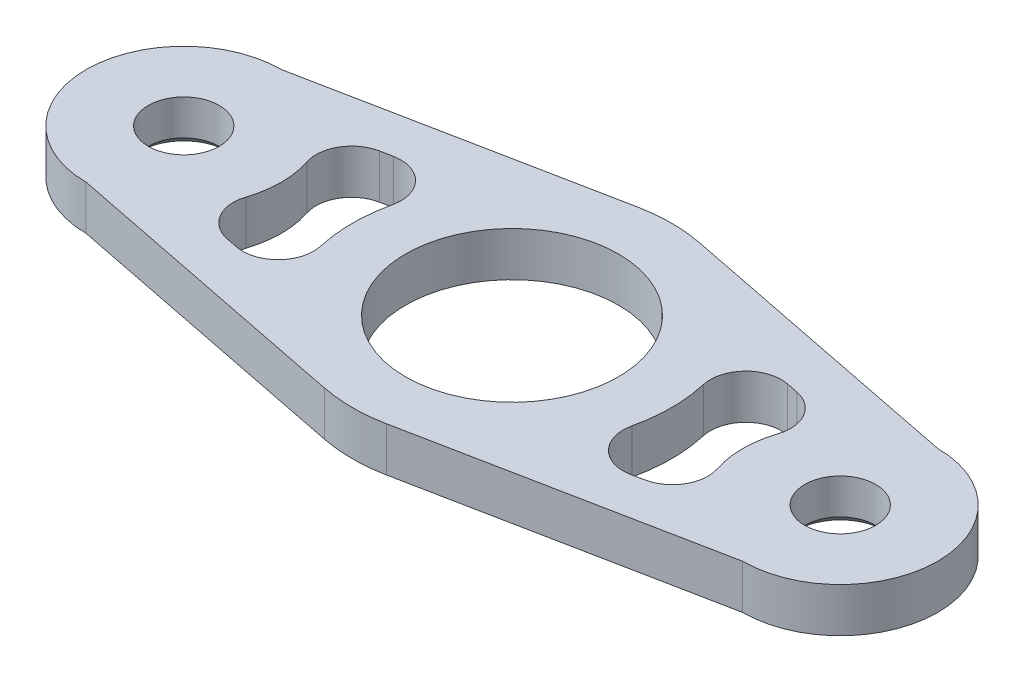
ISO-10303-21;
HEADER;
FILE_DESCRIPTION(('STEP AP214'),'2;1');
FILE_NAME('part.step','',(''),(''),'','','');
FILE_SCHEMA(('AUTOMOTIVE_DESIGN { 1 0 10303 214 1 1 1 1 }'));
ENDSEC;
DATA;
#1=APPLICATION_CONTEXT('core data for automotive mechanical design processes');
#2=APPLICATION_PROTOCOL_DEFINITION('international standard','automotive_design',2000,#1);
#3=PRODUCT_CONTEXT('',#1,'mechanical');
#4=PRODUCT('Part','Part','',(#3));
#5=PRODUCT_RELATED_PRODUCT_CATEGORY('part','',(#4));
#6=PRODUCT_DEFINITION_FORMATION('','',#4);
#7=PRODUCT_DEFINITION_CONTEXT('part definition',#1,'design');
#8=PRODUCT_DEFINITION('design','',#6,#7);
#9=PRODUCT_DEFINITION_SHAPE('','',#8);
#10=(LENGTH_UNIT() NAMED_UNIT(*) SI_UNIT(.MILLI.,.METRE.));
#11=(NAMED_UNIT(*) PLANE_ANGLE_UNIT() SI_UNIT($,.RADIAN.));
#12=(NAMED_UNIT(*) SI_UNIT($,.STERADIAN.) SOLID_ANGLE_UNIT());
#13=UNCERTAINTY_MEASURE_WITH_UNIT(LENGTH_MEASURE(1.E-05),#10,'distance_accuracy_value','');
#14=(GEOMETRIC_REPRESENTATION_CONTEXT(3) GLOBAL_UNCERTAINTY_ASSIGNED_CONTEXT((#13)) GLOBAL_UNIT_ASSIGNED_CONTEXT((#10,
#11,#12)) REPRESENTATION_CONTEXT('',''));
#15=CARTESIAN_POINT('',(0.,0.,0.));
#16=DIRECTION('',(0.,0.,1.));
#17=DIRECTION('',(1.,0.,0.));
#18=AXIS2_PLACEMENT_3D('',#15,#16,#17);
#19=CARTESIAN_POINT('',(3.50801681391295,2.5,-17.65485253502));
#20=DIRECTION('',(-0.194889822995164,0.,0.980825140834447));
#21=DIRECTION('',(0.980825140834447,0.,0.194889822995164));
#22=AXIS2_PLACEMENT_3D('',#19,#20,#21);
#23=PLANE('',#22);
#24=DIRECTION('',(-0.980825140834447,0.,-0.194889822995164));
#25=VECTOR('',#24,1.);
#26=CARTESIAN_POINT('',(3.50801681391295,-2.5,-17.65485253502));
#27=LINE('',#26,#25);
#28=CARTESIAN_POINT('',(37.,-2.5,-11.));
#29=VERTEX_POINT('',#28);
#30=CARTESIAN_POINT('',(3.50801681391295,-2.5,-17.65485253502));
#31=VERTEX_POINT('',#30);
#32=EDGE_CURVE('E232',#29,#31,#27,.T.);
#33=ORIENTED_EDGE('',*,*,#32,.T.);
#34=DIRECTION('',(0.,-1.,0.));
#35=VECTOR('',#34,1.);
#36=CARTESIAN_POINT('',(3.50801681391295,2.5,-17.65485253502));
#37=LINE('',#36,#35);
#38=CARTESIAN_POINT('',(3.50801681391295,2.5,-17.65485253502));
#39=VERTEX_POINT('',#38);
#40=EDGE_CURVE('E211',#39,#31,#37,.T.);
#41=ORIENTED_EDGE('',*,*,#40,.F.);
#42=DIRECTION('',(-0.980825140834447,0.,-0.194889822995164));
#43=VECTOR('',#42,1.);
#44=CARTESIAN_POINT('',(3.50801681391295,2.5,-17.65485253502));
#45=LINE('',#44,#43);
#46=CARTESIAN_POINT('',(37.,2.5,-11.));
#47=VERTEX_POINT('',#46);
#48=EDGE_CURVE('E219',#47,#39,#45,.T.);
#49=ORIENTED_EDGE('',*,*,#48,.F.);
#50=DIRECTION('',(0.,-1.,0.));
#51=VECTOR('',#50,1.);
#52=CARTESIAN_POINT('',(37.,2.5,-11.));
#53=LINE('',#52,#51);
#54=EDGE_CURVE('E435',#47,#29,#53,.T.);
#55=ORIENTED_EDGE('',*,*,#54,.T.);
#56=EDGE_LOOP('',(#33,#41,#49,#55));
#57=FACE_BOUND('',#56,.T.);
#58=ADVANCED_FACE('F41',(#57),#23,.F.);
#59=CARTESIAN_POINT('',(0.,2.5,0.));
#60=DIRECTION('',(0.,-1.,0.));
#61=DIRECTION('',(0.,0.,-1.));
#62=AXIS2_PLACEMENT_3D('',#59,#60,#61);
#63=CYLINDRICAL_SURFACE('',#62,18.);
#64=CARTESIAN_POINT('',(0.,-2.5,0.));
#65=DIRECTION('',(0.,1.,0.));
#66=DIRECTION('',(0.,0.,1.));
#67=AXIS2_PLACEMENT_3D('',#64,#65,#66);
#68=CIRCLE('',#67,18.);
#69=CARTESIAN_POINT('',(-3.50801681391295,-2.5,-17.65485253502));
#70=VERTEX_POINT('',#69);
#71=EDGE_CURVE('E473',#31,#70,#68,.T.);
#72=ORIENTED_EDGE('',*,*,#71,.T.);
#73=DIRECTION('',(0.,-1.,0.));
#74=VECTOR('',#73,1.);
#75=CARTESIAN_POINT('',(-3.50801681391295,2.5,-17.65485253502));
#76=LINE('',#75,#74);
#77=CARTESIAN_POINT('',(-3.50801681391295,2.5,-17.65485253502));
#78=VERTEX_POINT('',#77);
#79=EDGE_CURVE('E213',#78,#70,#76,.T.);
#80=ORIENTED_EDGE('',*,*,#79,.F.);
#81=CARTESIAN_POINT('',(0.,2.5,0.));
#82=DIRECTION('',(0.,1.,0.));
#83=DIRECTION('',(0.,0.,1.));
#84=AXIS2_PLACEMENT_3D('',#81,#82,#83);
#85=CIRCLE('',#84,18.);
#86=EDGE_CURVE('E206',#39,#78,#85,.T.);
#87=ORIENTED_EDGE('',*,*,#86,.F.);
#88=ORIENTED_EDGE('',*,*,#40,.T.);
#89=EDGE_LOOP('',(#72,#80,#87,#88));
#90=FACE_BOUND('',#89,.T.);
#91=ADVANCED_FACE('F209',(#90),#63,.T.);
#92=CARTESIAN_POINT('',(-3.50801681391296,2.5,-17.65485253502));
#93=DIRECTION('',(-0.194889822995164,0.,-0.980825140834447));
#94=DIRECTION('',(-0.980825140834447,0.,0.194889822995164));
#95=AXIS2_PLACEMENT_3D('',#92,#93,#94);
#96=PLANE('',#95);
#97=DIRECTION('',(0.980825140834447,0.,-0.194889822995164));
#98=VECTOR('',#97,1.);
#99=CARTESIAN_POINT('',(-3.50801681391296,-2.5,-17.65485253502));
#100=LINE('',#99,#98);
#101=CARTESIAN_POINT('',(-37.,-2.5,-11.));
#102=VERTEX_POINT('',#101);
#103=EDGE_CURVE('E476',#102,#70,#100,.T.);
#104=ORIENTED_EDGE('',*,*,#103,.F.);
#105=DIRECTION('',(0.,-1.,0.));
#106=VECTOR('',#105,1.);
#107=CARTESIAN_POINT('',(-37.,2.5,-11.));
#108=LINE('',#107,#106);
#109=CARTESIAN_POINT('',(-37.,2.5,-11.));
#110=VERTEX_POINT('',#109);
#111=EDGE_CURVE('E240',#110,#102,#108,.T.);
#112=ORIENTED_EDGE('',*,*,#111,.F.);
#113=DIRECTION('',(0.980825140834447,0.,-0.194889822995164));
#114=VECTOR('',#113,1.);
#115=CARTESIAN_POINT('',(-3.50801681391296,2.5,-17.65485253502));
#116=LINE('',#115,#114);
#117=EDGE_CURVE('E218',#110,#78,#116,.T.);
#118=ORIENTED_EDGE('',*,*,#117,.T.);
#119=ORIENTED_EDGE('',*,*,#79,.T.);
#120=EDGE_LOOP('',(#104,#112,#118,#119));
#121=FACE_BOUND('',#120,.T.);
#122=ADVANCED_FACE('F519',(#121),#96,.T.);
#123=CARTESIAN_POINT('',(-37.,2.5,0.));
#124=DIRECTION('',(0.,-1.,0.));
#125=DIRECTION('',(0.,0.,-1.));
#126=AXIS2_PLACEMENT_3D('',#123,#124,#125);
#127=CYLINDRICAL_SURFACE('',#126,11.);
#128=CARTESIAN_POINT('',(-37.,-2.5,0.));
#129=DIRECTION('',(0.,1.,0.));
#130=DIRECTION('',(0.,0.,1.));
#131=AXIS2_PLACEMENT_3D('',#128,#129,#130);
#132=CIRCLE('',#131,11.);
#133=CARTESIAN_POINT('',(-37.,-2.5,11.));
#134=VERTEX_POINT('',#133);
#135=EDGE_CURVE('E480',#102,#134,#132,.T.);
#136=ORIENTED_EDGE('',*,*,#135,.T.);
#137=DIRECTION('',(0.,-1.,0.));
#138=VECTOR('',#137,1.);
#139=CARTESIAN_POINT('',(-37.,2.5,11.));
#140=LINE('',#139,#138);
#141=CARTESIAN_POINT('',(-37.,2.5,11.));
#142=VERTEX_POINT('',#141);
#143=EDGE_CURVE('E505',#142,#134,#140,.T.);
#144=ORIENTED_EDGE('',*,*,#143,.F.);
#145=CARTESIAN_POINT('',(-37.,2.5,0.));
#146=DIRECTION('',(0.,1.,0.));
#147=DIRECTION('',(0.,0.,1.));
#148=AXIS2_PLACEMENT_3D('',#145,#146,#147);
#149=CIRCLE('',#148,11.);
#150=EDGE_CURVE('E420',#110,#142,#149,.T.);
#151=ORIENTED_EDGE('',*,*,#150,.F.);
#152=ORIENTED_EDGE('',*,*,#111,.T.);
#153=EDGE_LOOP('',(#136,#144,#151,#152));
#154=FACE_BOUND('',#153,.T.);
#155=ADVANCED_FACE('F512',(#154),#127,.T.);
#156=CARTESIAN_POINT('',(-3.50801681391296,2.5,17.65485253502));
#157=DIRECTION('',(0.194889822995164,0.,-0.980825140834447));
#158=DIRECTION('',(-0.980825140834447,0.,-0.194889822995164));
#159=AXIS2_PLACEMENT_3D('',#156,#157,#158);
#160=PLANE('',#159);
#161=DIRECTION('',(0.980825140834447,0.,0.194889822995164));
#162=VECTOR('',#161,1.);
#163=CARTESIAN_POINT('',(-3.50801681391296,-2.5,17.65485253502));
#164=LINE('',#163,#162);
#165=CARTESIAN_POINT('',(-3.50801681391295,-2.5,17.65485253502));
#166=VERTEX_POINT('',#165);
#167=EDGE_CURVE('E483',#134,#166,#164,.T.);
#168=ORIENTED_EDGE('',*,*,#167,.T.);
#169=DIRECTION('',(0.,-1.,0.));
#170=VECTOR('',#169,1.);
#171=CARTESIAN_POINT('',(-3.50801681391295,2.5,17.65485253502));
#172=LINE('',#171,#170);
#173=CARTESIAN_POINT('',(-3.50801681391295,2.5,17.65485253502));
#174=VERTEX_POINT('',#173);
#175=EDGE_CURVE('E501',#174,#166,#172,.T.);
#176=ORIENTED_EDGE('',*,*,#175,.F.);
#177=DIRECTION('',(0.980825140834447,0.,0.194889822995164));
#178=VECTOR('',#177,1.);
#179=CARTESIAN_POINT('',(-3.50801681391296,2.5,17.65485253502));
#180=LINE('',#179,#178);
#181=EDGE_CURVE('E423',#142,#174,#180,.T.);
#182=ORIENTED_EDGE('',*,*,#181,.F.);
#183=ORIENTED_EDGE('',*,*,#143,.T.);
#184=EDGE_LOOP('',(#168,#176,#182,#183));
#185=FACE_BOUND('',#184,.T.);
#186=ADVANCED_FACE('F532',(#185),#160,.F.);
#187=CARTESIAN_POINT('',(0.,2.5,0.));
#188=DIRECTION('',(0.,-1.,0.));
#189=DIRECTION('',(0.,0.,-1.));
#190=AXIS2_PLACEMENT_3D('',#187,#188,#189);
#191=CYLINDRICAL_SURFACE('',#190,18.);
#192=CARTESIAN_POINT('',(0.,-2.5,0.));
#193=DIRECTION('',(0.,1.,0.));
#194=DIRECTION('',(0.,0.,1.));
#195=AXIS2_PLACEMENT_3D('',#192,#193,#194);
#196=CIRCLE('',#195,18.);
#197=CARTESIAN_POINT('',(3.50801681391295,-2.5,17.65485253502));
#198=VERTEX_POINT('',#197);
#199=EDGE_CURVE('E486',#166,#198,#196,.T.);
#200=ORIENTED_EDGE('',*,*,#199,.T.);
#201=DIRECTION('',(0.,-1.,0.));
#202=VECTOR('',#201,1.);
#203=CARTESIAN_POINT('',(3.50801681391295,2.5,17.65485253502));
#204=LINE('',#203,#202);
#205=CARTESIAN_POINT('',(3.50801681391295,2.5,17.65485253502));
#206=VERTEX_POINT('',#205);
#207=EDGE_CURVE('E498',#206,#198,#204,.T.);
#208=ORIENTED_EDGE('',*,*,#207,.F.);
#209=CARTESIAN_POINT('',(0.,2.5,0.));
#210=DIRECTION('',(0.,1.,0.));
#211=DIRECTION('',(0.,0.,1.));
#212=AXIS2_PLACEMENT_3D('',#209,#210,#211);
#213=CIRCLE('',#212,18.);
#214=EDGE_CURVE('E426',#174,#206,#213,.T.);
#215=ORIENTED_EDGE('',*,*,#214,.F.);
#216=ORIENTED_EDGE('',*,*,#175,.T.);
#217=EDGE_LOOP('',(#200,#208,#215,#216));
#218=FACE_BOUND('',#217,.T.);
#219=ADVANCED_FACE('F527',(#218),#191,.T.);
#220=CARTESIAN_POINT('',(3.50801681391295,2.5,17.65485253502));
#221=DIRECTION('',(0.194889822995164,0.,0.980825140834447));
#222=DIRECTION('',(0.980825140834447,0.,-0.194889822995164));
#223=AXIS2_PLACEMENT_3D('',#220,#221,#222);
#224=PLANE('',#223);
#225=DIRECTION('',(-0.980825140834447,0.,0.194889822995164));
#226=VECTOR('',#225,1.);
#227=CARTESIAN_POINT('',(3.50801681391295,-2.5,17.65485253502));
#228=LINE('',#227,#226);
#229=CARTESIAN_POINT('',(37.,-2.5,11.));
#230=VERTEX_POINT('',#229);
#231=EDGE_CURVE('E382',#230,#198,#228,.T.);
#232=ORIENTED_EDGE('',*,*,#231,.F.);
#233=DIRECTION('',(0.,-1.,0.));
#234=VECTOR('',#233,1.);
#235=CARTESIAN_POINT('',(37.,2.5,11.));
#236=LINE('',#235,#234);
#237=CARTESIAN_POINT('',(37.,2.5,11.));
#238=VERTEX_POINT('',#237);
#239=EDGE_CURVE('E495',#238,#230,#236,.T.);
#240=ORIENTED_EDGE('',*,*,#239,.F.);
#241=DIRECTION('',(-0.980825140834447,0.,0.194889822995164));
#242=VECTOR('',#241,1.);
#243=CARTESIAN_POINT('',(3.50801681391295,2.5,17.65485253502));
#244=LINE('',#243,#242);
#245=EDGE_CURVE('E429',#238,#206,#244,.T.);
#246=ORIENTED_EDGE('',*,*,#245,.T.);
#247=ORIENTED_EDGE('',*,*,#207,.T.);
#248=EDGE_LOOP('',(#232,#240,#246,#247));
#249=FACE_BOUND('',#248,.T.);
#250=ADVANCED_FACE('F524',(#249),#224,.T.);
#251=CARTESIAN_POINT('',(0.,2.5,0.));
#252=DIRECTION('',(0.,-1.,0.));
#253=DIRECTION('',(0.,0.,-1.));
#254=AXIS2_PLACEMENT_3D('',#251,#252,#253);
#255=CYLINDRICAL_SURFACE('',#254,18.);
#256=CARTESIAN_POINT('',(0.,2.5,0.));
#257=DIRECTION('',(0.,1.,0.));
#258=DIRECTION('',(0.,0.,1.));
#259=AXIS2_PLACEMENT_3D('',#256,#257,#258);
#260=CIRCLE('',#259,18.);
#261=CARTESIAN_POINT('',(17.5450382963122,2.5,-4.02139667042898));
#262=VERTEX_POINT('',#261);
#263=CARTESIAN_POINT('',(17.5450382963122,2.5,4.02139667042898));
#264=VERTEX_POINT('',#263);
#265=EDGE_CURVE('E403',#262,#264,#260,.F.);
#266=ORIENTED_EDGE('',*,*,#265,.T.);
#267=DIRECTION('',(0.,-1.,0.));
#268=VECTOR('',#267,1.);
#269=CARTESIAN_POINT('',(17.5450382963122,2.5,4.02139667042898));
#270=LINE('',#269,#268);
#271=CARTESIAN_POINT('',(17.5450382963122,-2.5,4.02139667042898));
#272=VERTEX_POINT('',#271);
#273=EDGE_CURVE('E238',#264,#272,#270,.T.);
#274=ORIENTED_EDGE('',*,*,#273,.T.);
#275=CARTESIAN_POINT('',(0.,-2.5,0.));
#276=DIRECTION('',(0.,1.,0.));
#277=DIRECTION('',(0.,0.,1.));
#278=AXIS2_PLACEMENT_3D('',#275,#276,#277);
#279=CIRCLE('',#278,18.);
#280=CARTESIAN_POINT('',(17.5450382963122,-2.5,-4.02139667042898));
#281=VERTEX_POINT('',#280);
#282=EDGE_CURVE('E455',#281,#272,#279,.F.);
#283=ORIENTED_EDGE('',*,*,#282,.F.);
#284=DIRECTION('',(0.,-1.,0.));
#285=VECTOR('',#284,1.);
#286=CARTESIAN_POINT('',(17.5450382963122,2.5,-4.02139667042898));
#287=LINE('',#286,#285);
#288=EDGE_CURVE('E234',#281,#262,#287,.F.);
#289=ORIENTED_EDGE('',*,*,#288,.T.);
#290=EDGE_LOOP('',(#266,#274,#283,#289));
#291=FACE_BOUND('',#290,.T.);
#292=ADVANCED_FACE('F563',(#291),#255,.T.);
#293=CARTESIAN_POINT('',(2.53356769893713,2.5,-12.7507268308478));
#294=DIRECTION('',(-0.194889822995164,0.,0.980825140834447));
#295=DIRECTION('',(0.980825140834447,0.,0.194889822995164));
#296=AXIS2_PLACEMENT_3D('',#293,#294,#295);
#297=PLANE('',#296);
#298=DIRECTION('',(-0.980825140834447,0.,-0.194889822995164));
#299=VECTOR('',#298,1.);
#300=CARTESIAN_POINT('',(2.53356769893713,-2.5,-12.7507268308478));
#301=LINE('',#300,#299);
#302=CARTESIAN_POINT('',(23.5208771712054,-2.5,-8.58055127364778));
#303=VERTEX_POINT('',#302);
#304=CARTESIAN_POINT('',(22.2234949874734,-2.5,-8.83834093830655));
#305=VERTEX_POINT('',#304);
#306=EDGE_CURVE('E459',#303,#305,#301,.T.);
#307=ORIENTED_EDGE('',*,*,#306,.F.);
#308=DIRECTION('',(0.,1.,0.));
#309=VECTOR('',#308,1.);
#310=CARTESIAN_POINT('',(23.5208771712054,2.5,-8.58055127364777));
#311=LINE('',#310,#309);
#312=CARTESIAN_POINT('',(23.5208771712054,2.5,-8.58055127364778));
#313=VERTEX_POINT('',#312);
#314=EDGE_CURVE('E265',#303,#313,#311,.T.);
#315=ORIENTED_EDGE('',*,*,#314,.T.);
#316=DIRECTION('',(-0.980825140834447,0.,-0.194889822995164));
#317=VECTOR('',#316,1.);
#318=CARTESIAN_POINT('',(2.53356769893713,2.5,-12.7507268308478));
#319=LINE('',#318,#317);
#320=CARTESIAN_POINT('',(22.2234949874734,2.5,-8.83834093830655));
#321=VERTEX_POINT('',#320);
#322=EDGE_CURVE('E407',#313,#321,#319,.T.);
#323=ORIENTED_EDGE('',*,*,#322,.T.);
#324=DIRECTION('',(0.,1.,0.));
#325=VECTOR('',#324,1.);
#326=CARTESIAN_POINT('',(22.2234949874734,-2.5,-8.83834093830655));
#327=LINE('',#326,#325);
#328=EDGE_CURVE('E261',#321,#305,#327,.F.);
#329=ORIENTED_EDGE('',*,*,#328,.T.);
#330=EDGE_LOOP('',(#307,#315,#323,#329));
#331=FACE_BOUND('',#330,.T.);
#332=ADVANCED_FACE('F559',(#331),#297,.T.);
#333=CARTESIAN_POINT('',(37.,2.5,0.));
#334=DIRECTION('',(0.,-1.,0.));
#335=DIRECTION('',(0.,0.,-1.));
#336=AXIS2_PLACEMENT_3D('',#333,#334,#335);
#337=CYLINDRICAL_SURFACE('',#336,11.);
#338=CARTESIAN_POINT('',(37.,-2.5,0.));
#339=DIRECTION('',(0.,1.,0.));
#340=DIRECTION('',(0.,0.,1.));
#341=AXIS2_PLACEMENT_3D('',#338,#339,#340);
#342=CIRCLE('',#341,11.);
#343=CARTESIAN_POINT('',(26.5436331114315,-2.5,3.41531718756065));
#344=VERTEX_POINT('',#343);
#345=CARTESIAN_POINT('',(26.5436331114315,-2.5,-3.41531718756065));
#346=VERTEX_POINT('',#345);
#347=EDGE_CURVE('E463',#344,#346,#342,.F.);
#348=ORIENTED_EDGE('',*,*,#347,.F.);
#349=DIRECTION('',(0.,-1.,0.));
#350=VECTOR('',#349,1.);
#351=CARTESIAN_POINT('',(26.5436331114315,2.5,3.41531718756065));
#352=LINE('',#351,#350);
#353=CARTESIAN_POINT('',(26.5436331114315,2.5,3.41531718756065));
#354=VERTEX_POINT('',#353);
#355=EDGE_CURVE('E258',#344,#354,#352,.F.);
#356=ORIENTED_EDGE('',*,*,#355,.T.);
#357=CARTESIAN_POINT('',(37.,2.5,0.));
#358=DIRECTION('',(0.,1.,0.));
#359=DIRECTION('',(0.,0.,1.));
#360=AXIS2_PLACEMENT_3D('',#357,#358,#359);
#361=CIRCLE('',#360,11.);
#362=CARTESIAN_POINT('',(26.5436331114315,2.5,-3.41531718756065));
#363=VERTEX_POINT('',#362);
#364=EDGE_CURVE('E411',#354,#363,#361,.F.);
#365=ORIENTED_EDGE('',*,*,#364,.T.);
#366=DIRECTION('',(0.,-1.,0.));
#367=VECTOR('',#366,1.);
#368=CARTESIAN_POINT('',(26.5436331114315,2.5,-3.41531718756065));
#369=LINE('',#368,#367);
#370=EDGE_CURVE('E254',#363,#346,#369,.T.);
#371=ORIENTED_EDGE('',*,*,#370,.T.);
#372=EDGE_LOOP('',(#348,#356,#365,#371));
#373=FACE_BOUND('',#372,.T.);
#374=ADVANCED_FACE('F555',(#373),#337,.T.);
#375=CARTESIAN_POINT('',(-2.53356769893714,2.5,12.7507268308478));
#376=DIRECTION('',(0.194889822995164,0.,-0.980825140834447));
#377=DIRECTION('',(-0.980825140834447,0.,-0.194889822995164));
#378=AXIS2_PLACEMENT_3D('',#375,#376,#377);
#379=PLANE('',#378);
#380=DIRECTION('',(0.980825140834447,0.,0.194889822995164));
#381=VECTOR('',#380,1.);
#382=CARTESIAN_POINT('',(-2.53356769893714,2.5,12.7507268308478));
#383=LINE('',#382,#381);
#384=CARTESIAN_POINT('',(-23.5208771712054,2.5,8.58055127364778));
#385=VERTEX_POINT('',#384);
#386=CARTESIAN_POINT('',(-22.2234949874734,2.5,8.83834093830655));
#387=VERTEX_POINT('',#386);
#388=EDGE_CURVE('E388',#385,#387,#383,.T.);
#389=ORIENTED_EDGE('',*,*,#388,.T.);
#390=DIRECTION('',(0.,-1.,0.));
#391=VECTOR('',#390,1.);
#392=CARTESIAN_POINT('',(-22.2234949874734,2.5,8.83834093830655));
#393=LINE('',#392,#391);
#394=CARTESIAN_POINT('',(-22.2234949874734,-2.5,8.83834093830655));
#395=VERTEX_POINT('',#394);
#396=EDGE_CURVE('E271',#387,#395,#393,.T.);
#397=ORIENTED_EDGE('',*,*,#396,.T.);
#398=DIRECTION('',(0.980825140834447,0.,0.194889822995164));
#399=VECTOR('',#398,1.);
#400=CARTESIAN_POINT('',(-2.53356769893714,-2.5,12.7507268308478));
#401=LINE('',#400,#399);
#402=CARTESIAN_POINT('',(-23.5208771712054,-2.5,8.58055127364778));
#403=VERTEX_POINT('',#402);
#404=EDGE_CURVE('E440',#403,#395,#401,.T.);
#405=ORIENTED_EDGE('',*,*,#404,.F.);
#406=DIRECTION('',(0.,-1.,0.));
#407=VECTOR('',#406,1.);
#408=CARTESIAN_POINT('',(-23.5208771712054,2.5,8.58055127364778));
#409=LINE('',#408,#407);
#410=EDGE_CURVE('E268',#403,#385,#409,.F.);
#411=ORIENTED_EDGE('',*,*,#410,.T.);
#412=EDGE_LOOP('',(#389,#397,#405,#411));
#413=FACE_BOUND('',#412,.T.);
#414=ADVANCED_FACE('F558',(#413),#379,.T.);
#415=CARTESIAN_POINT('',(-37.,2.5,0.));
#416=DIRECTION('',(0.,-1.,0.));
#417=DIRECTION('',(0.,0.,-1.));
#418=AXIS2_PLACEMENT_3D('',#415,#416,#417);
#419=CYLINDRICAL_SURFACE('',#418,11.);
#420=CARTESIAN_POINT('',(-37.,-2.5,0.));
#421=DIRECTION('',(0.,1.,0.));
#422=DIRECTION('',(0.,0.,1.));
#423=AXIS2_PLACEMENT_3D('',#420,#421,#422);
#424=CIRCLE('',#423,11.);
#425=CARTESIAN_POINT('',(-26.5436331114315,-2.5,3.41531718756066));
#426=VERTEX_POINT('',#425);
#427=CARTESIAN_POINT('',(-26.5436331114315,-2.5,-3.41531718756066));
#428=VERTEX_POINT('',#427);
#429=EDGE_CURVE('E444',#426,#428,#424,.T.);
#430=ORIENTED_EDGE('',*,*,#429,.T.);
#431=DIRECTION('',(0.,-1.,0.));
#432=VECTOR('',#431,1.);
#433=CARTESIAN_POINT('',(-26.5436331114315,2.5,-3.41531718756066));
#434=LINE('',#433,#432);
#435=CARTESIAN_POINT('',(-26.5436331114315,2.5,-3.41531718756066));
#436=VERTEX_POINT('',#435);
#437=EDGE_CURVE('E58',#428,#436,#434,.F.);
#438=ORIENTED_EDGE('',*,*,#437,.T.);
#439=CARTESIAN_POINT('',(-37.,2.5,0.));
#440=DIRECTION('',(0.,1.,0.));
#441=DIRECTION('',(0.,0.,1.));
#442=AXIS2_PLACEMENT_3D('',#439,#440,#441);
#443=CIRCLE('',#442,11.);
#444=CARTESIAN_POINT('',(-26.5436331114315,2.5,3.41531718756066));
#445=VERTEX_POINT('',#444);
#446=EDGE_CURVE('E392',#445,#436,#443,.T.);
#447=ORIENTED_EDGE('',*,*,#446,.F.);
#448=DIRECTION('',(0.,-1.,0.));
#449=VECTOR('',#448,1.);
#450=CARTESIAN_POINT('',(-26.5436331114315,2.5,3.41531718756066));
#451=LINE('',#450,#449);
#452=EDGE_CURVE('E289',#445,#426,#451,.T.);
#453=ORIENTED_EDGE('',*,*,#452,.T.);
#454=EDGE_LOOP('',(#430,#438,#447,#453));
#455=FACE_BOUND('',#454,.T.);
#456=ADVANCED_FACE('F574',(#455),#419,.T.);
#457=CARTESIAN_POINT('',(-2.53356769893714,2.5,-12.7507268308478));
#458=DIRECTION('',(-0.194889822995164,0.,-0.980825140834447));
#459=DIRECTION('',(-0.980825140834447,0.,0.194889822995164));
#460=AXIS2_PLACEMENT_3D('',#457,#458,#459);
#461=PLANE('',#460);
#462=DIRECTION('',(0.980825140834447,0.,-0.194889822995164));
#463=VECTOR('',#462,1.);
#464=CARTESIAN_POINT('',(-2.53356769893714,-2.5,-12.7507268308478));
#465=LINE('',#464,#463);
#466=CARTESIAN_POINT('',(-23.5208771712054,-2.5,-8.58055127364778));
#467=VERTEX_POINT('',#466);
#468=CARTESIAN_POINT('',(-22.2234949874734,-2.5,-8.83834093830655));
#469=VERTEX_POINT('',#468);
#470=EDGE_CURVE('E447',#467,#469,#465,.T.);
#471=ORIENTED_EDGE('',*,*,#470,.T.);
#472=DIRECTION('',(0.,1.,0.));
#473=VECTOR('',#472,1.);
#474=CARTESIAN_POINT('',(-22.2234949874734,2.5,-8.83834093830655));
#475=LINE('',#474,#473);
#476=CARTESIAN_POINT('',(-22.2234949874734,2.5,-8.83834093830655));
#477=VERTEX_POINT('',#476);
#478=EDGE_CURVE('E286',#469,#477,#475,.T.);
#479=ORIENTED_EDGE('',*,*,#478,.T.);
#480=DIRECTION('',(0.980825140834447,0.,-0.194889822995164));
#481=VECTOR('',#480,1.);
#482=CARTESIAN_POINT('',(-2.53356769893714,2.5,-12.7507268308478));
#483=LINE('',#482,#481);
#484=CARTESIAN_POINT('',(-23.5208771712054,2.5,-8.58055127364778));
#485=VERTEX_POINT('',#484);
#486=EDGE_CURVE('E395',#485,#477,#483,.T.);
#487=ORIENTED_EDGE('',*,*,#486,.F.);
#488=DIRECTION('',(0.,1.,0.));
#489=VECTOR('',#488,1.);
#490=CARTESIAN_POINT('',(-23.5208771712054,-2.5,-8.58055127364778));
#491=LINE('',#490,#489);
#492=EDGE_CURVE('E282',#485,#467,#491,.F.);
#493=ORIENTED_EDGE('',*,*,#492,.T.);
#494=EDGE_LOOP('',(#471,#479,#487,#493));
#495=FACE_BOUND('',#494,.T.);
#496=ADVANCED_FACE('F553',(#495),#461,.F.);
#497=CARTESIAN_POINT('',(2.53356769893713,2.5,12.7507268308478));
#498=DIRECTION('',(0.194889822995164,0.,0.980825140834447));
#499=DIRECTION('',(0.980825140834447,0.,-0.194889822995164));
#500=AXIS2_PLACEMENT_3D('',#497,#498,#499);
#501=PLANE('',#500);
#502=DIRECTION('',(-0.980825140834447,0.,0.194889822995164));
#503=VECTOR('',#502,1.);
#504=CARTESIAN_POINT('',(2.53356769893713,-2.5,12.7507268308478));
#505=LINE('',#504,#503);
#506=CARTESIAN_POINT('',(23.5208771712054,-2.5,8.58055127364778));
#507=VERTEX_POINT('',#506);
#508=CARTESIAN_POINT('',(22.2234949874734,-2.5,8.83834093830655));
#509=VERTEX_POINT('',#508);
#510=EDGE_CURVE('E467',#507,#509,#505,.T.);
#511=ORIENTED_EDGE('',*,*,#510,.T.);
#512=DIRECTION('',(0.,-1.,0.));
#513=VECTOR('',#512,1.);
#514=CARTESIAN_POINT('',(22.2234949874734,2.5,8.83834093830655));
#515=LINE('',#514,#513);
#516=CARTESIAN_POINT('',(22.2234949874734,2.5,8.83834093830655));
#517=VERTEX_POINT('',#516);
#518=EDGE_CURVE('E251',#509,#517,#515,.F.);
#519=ORIENTED_EDGE('',*,*,#518,.T.);
#520=DIRECTION('',(-0.980825140834447,0.,0.194889822995164));
#521=VECTOR('',#520,1.);
#522=CARTESIAN_POINT('',(2.53356769893713,2.5,12.7507268308478));
#523=LINE('',#522,#521);
#524=CARTESIAN_POINT('',(23.5208771712054,2.5,8.58055127364778));
#525=VERTEX_POINT('',#524);
#526=EDGE_CURVE('E229',#525,#517,#523,.T.);
#527=ORIENTED_EDGE('',*,*,#526,.F.);
#528=DIRECTION('',(0.,-1.,0.));
#529=VECTOR('',#528,1.);
#530=CARTESIAN_POINT('',(23.5208771712054,2.5,8.58055127364777));
#531=LINE('',#530,#529);
#532=EDGE_CURVE('E247',#525,#507,#531,.T.);
#533=ORIENTED_EDGE('',*,*,#532,.T.);
#534=EDGE_LOOP('',(#511,#519,#527,#533));
#535=FACE_BOUND('',#534,.T.);
#536=ADVANCED_FACE('F549',(#535),#501,.F.);
#537=CARTESIAN_POINT('',(0.,2.5,0.));
#538=DIRECTION('',(0.,-1.,0.));
#539=DIRECTION('',(0.,0.,-1.));
#540=AXIS2_PLACEMENT_3D('',#537,#538,#539);
#541=CYLINDRICAL_SURFACE('',#540,18.);
#542=CARTESIAN_POINT('',(0.,-2.5,0.));
#543=DIRECTION('',(0.,1.,0.));
#544=DIRECTION('',(0.,0.,1.));
#545=AXIS2_PLACEMENT_3D('',#542,#543,#544);
#546=CIRCLE('',#545,18.);
#547=CARTESIAN_POINT('',(-17.5450382963122,-2.5,-4.02139667042899));
#548=VERTEX_POINT('',#547);
#549=CARTESIAN_POINT('',(-17.5450382963122,-2.5,4.02139667042899));
#550=VERTEX_POINT('',#549);
#551=EDGE_CURVE('E451',#548,#550,#546,.T.);
#552=ORIENTED_EDGE('',*,*,#551,.T.);
#553=DIRECTION('',(0.,-1.,0.));
#554=VECTOR('',#553,1.);
#555=CARTESIAN_POINT('',(-17.5450382963122,2.5,4.02139667042899));
#556=LINE('',#555,#554);
#557=CARTESIAN_POINT('',(-17.5450382963122,2.5,4.02139667042899));
#558=VERTEX_POINT('',#557);
#559=EDGE_CURVE('E279',#550,#558,#556,.F.);
#560=ORIENTED_EDGE('',*,*,#559,.T.);
#561=CARTESIAN_POINT('',(0.,2.5,0.));
#562=DIRECTION('',(0.,1.,0.));
#563=DIRECTION('',(0.,0.,1.));
#564=AXIS2_PLACEMENT_3D('',#561,#562,#563);
#565=CIRCLE('',#564,18.);
#566=CARTESIAN_POINT('',(-17.5450382963122,2.5,-4.02139667042899));
#567=VERTEX_POINT('',#566);
#568=EDGE_CURVE('E399',#567,#558,#565,.T.);
#569=ORIENTED_EDGE('',*,*,#568,.F.);
#570=DIRECTION('',(0.,-1.,0.));
#571=VECTOR('',#570,1.);
#572=CARTESIAN_POINT('',(-17.5450382963122,2.5,-4.02139667042899));
#573=LINE('',#572,#571);
#574=EDGE_CURVE('E275',#567,#548,#573,.T.);
#575=ORIENTED_EDGE('',*,*,#574,.T.);
#576=EDGE_LOOP('',(#552,#560,#569,#575));
#577=FACE_BOUND('',#576,.T.);
#578=ADVANCED_FACE('F552',(#577),#541,.T.);
#579=CARTESIAN_POINT('',(0.,2.5,0.));
#580=DIRECTION('',(0.,-1.,0.));
#581=DIRECTION('',(0.,0.,-1.));
#582=AXIS2_PLACEMENT_3D('',#579,#580,#581);
#583=CYLINDRICAL_SURFACE('',#582,12.);
#584=CARTESIAN_POINT('',(0.,2.5,0.));
#585=DIRECTION('',(0.,1.,0.));
#586=DIRECTION('',(0.,0.,1.));
#587=AXIS2_PLACEMENT_3D('',#584,#585,#586);
#588=CIRCLE('',#587,12.);
#589=CARTESIAN_POINT('',(0.,2.5,12.));
#590=VERTEX_POINT('',#589);
#591=EDGE_CURVE('E379',#590,#590,#588,.T.);
#592=ORIENTED_EDGE('',*,*,#591,.T.);
#593=EDGE_LOOP('',(#592));
#594=FACE_BOUND('',#593,.T.);
#595=CARTESIAN_POINT('',(0.,-2.5,0.));
#596=DIRECTION('',(0.,1.,0.));
#597=DIRECTION('',(0.,0.,1.));
#598=AXIS2_PLACEMENT_3D('',#595,#596,#597);
#599=CIRCLE('',#598,12.);
#600=CARTESIAN_POINT('',(0.,-2.5,12.));
#601=VERTEX_POINT('',#600);
#602=EDGE_CURVE('E436',#601,#601,#599,.T.);
#603=ORIENTED_EDGE('',*,*,#602,.F.);
#604=EDGE_LOOP('',(#603));
#605=FACE_BOUND('',#604,.T.);
#606=ADVANCED_FACE('F570',(#594,#605),#583,.F.);
#607=CARTESIAN_POINT('',(-37.,2.5,0.));
#608=DIRECTION('',(0.,-1.,0.));
#609=DIRECTION('',(0.,0.,-1.));
#610=AXIS2_PLACEMENT_3D('',#607,#608,#609);
#611=CYLINDRICAL_SURFACE('',#610,4.00000000000001);
#612=CARTESIAN_POINT('',(-37.,-1.5,0.));
#613=DIRECTION('',(0.,1.,0.));
#614=DIRECTION('',(0.,0.,1.));
#615=AXIS2_PLACEMENT_3D('',#612,#613,#614);
#616=CIRCLE('',#615,4.00000000000001);
#617=CARTESIAN_POINT('',(-37.,-1.5,4.00000000000001));
#618=VERTEX_POINT('',#617);
#619=EDGE_CURVE('E11',#618,#618,#616,.F.);
#620=ORIENTED_EDGE('',*,*,#619,.T.);
#621=EDGE_LOOP('',(#620));
#622=FACE_BOUND('',#621,.T.);
#623=CARTESIAN_POINT('',(-37.,2.5,0.));
#624=DIRECTION('',(0.,1.,0.));
#625=DIRECTION('',(0.,0.,1.));
#626=AXIS2_PLACEMENT_3D('',#623,#624,#625);
#627=CIRCLE('',#626,4.00000000000001);
#628=CARTESIAN_POINT('',(-37.,2.5,4.00000000000001));
#629=VERTEX_POINT('',#628);
#630=EDGE_CURVE('E373',#629,#629,#627,.T.);
#631=ORIENTED_EDGE('',*,*,#630,.T.);
#632=EDGE_LOOP('',(#631));
#633=FACE_BOUND('',#632,.T.);
#634=ADVANCED_FACE('F366',(#622,#633),#611,.F.);
#635=CARTESIAN_POINT('',(37.,2.5,0.));
#636=DIRECTION('',(0.,-1.,0.));
#637=DIRECTION('',(0.,0.,-1.));
#638=AXIS2_PLACEMENT_3D('',#635,#636,#637);
#639=CYLINDRICAL_SURFACE('',#638,4.00000000000001);
#640=CARTESIAN_POINT('',(37.,-1.5,0.));
#641=DIRECTION('',(0.,1.,0.));
#642=DIRECTION('',(0.,0.,1.));
#643=AXIS2_PLACEMENT_3D('',#640,#641,#642);
#644=CIRCLE('',#643,4.00000000000001);
#645=CARTESIAN_POINT('',(37.,-1.5,4.00000000000001));
#646=VERTEX_POINT('',#645);
#647=EDGE_CURVE('E342',#646,#646,#644,.F.);
#648=ORIENTED_EDGE('',*,*,#647,.T.);
#649=EDGE_LOOP('',(#648));
#650=FACE_BOUND('',#649,.T.);
#651=CARTESIAN_POINT('',(37.,2.5,0.));
#652=DIRECTION('',(0.,1.,0.));
#653=DIRECTION('',(0.,0.,1.));
#654=AXIS2_PLACEMENT_3D('',#651,#652,#653);
#655=CIRCLE('',#654,4.00000000000001);
#656=CARTESIAN_POINT('',(37.,2.5,4.00000000000001));
#657=VERTEX_POINT('',#656);
#658=EDGE_CURVE('E370',#657,#657,#655,.F.);
#659=ORIENTED_EDGE('',*,*,#658,.F.);
#660=EDGE_LOOP('',(#659));
#661=FACE_BOUND('',#660,.T.);
#662=ADVANCED_FACE('F362',(#650,#661),#639,.F.);
#663=CARTESIAN_POINT('',(37.,2.5,0.));
#664=DIRECTION('',(0.,-1.,0.));
#665=DIRECTION('',(0.,0.,-1.));
#666=AXIS2_PLACEMENT_3D('',#663,#664,#665);
#667=CYLINDRICAL_SURFACE('',#666,11.);
#668=CARTESIAN_POINT('',(37.,-2.5,0.));
#669=DIRECTION('',(0.,1.,0.));
#670=DIRECTION('',(0.,0.,1.));
#671=AXIS2_PLACEMENT_3D('',#668,#669,#670);
#672=CIRCLE('',#671,11.);
#673=EDGE_CURVE('E374',#29,#230,#672,.F.);
#674=ORIENTED_EDGE('',*,*,#673,.F.);
#675=ORIENTED_EDGE('',*,*,#54,.F.);
#676=CARTESIAN_POINT('',(37.,2.5,0.));
#677=DIRECTION('',(0.,1.,0.));
#678=DIRECTION('',(0.,0.,1.));
#679=AXIS2_PLACEMENT_3D('',#676,#677,#678);
#680=CIRCLE('',#679,11.);
#681=EDGE_CURVE('E226',#47,#238,#680,.F.);
#682=ORIENTED_EDGE('',*,*,#681,.T.);
#683=ORIENTED_EDGE('',*,*,#239,.T.);
#684=EDGE_LOOP('',(#674,#675,#682,#683));
#685=FACE_BOUND('',#684,.T.);
#686=ADVANCED_FACE('F365',(#685),#667,.T.);
#687=CARTESIAN_POINT('',(0.,2.5,0.));
#688=DIRECTION('',(0.,1.,0.));
#689=DIRECTION('',(0.,0.,1.));
#690=AXIS2_PLACEMENT_3D('',#687,#688,#689);
#691=PLANE('',#690);
#692=ORIENTED_EDGE('',*,*,#658,.T.);
#693=EDGE_LOOP('',(#692));
#694=FACE_BOUND('',#693,.T.);
#695=ORIENTED_EDGE('',*,*,#630,.F.);
#696=EDGE_LOOP('',(#695));
#697=FACE_BOUND('',#696,.T.);
#698=ORIENTED_EDGE('',*,*,#591,.F.);
#699=EDGE_LOOP('',(#698));
#700=FACE_BOUND('',#699,.T.);
#701=ORIENTED_EDGE('',*,*,#388,.F.);
#702=CARTESIAN_POINT('',(-22.7413178792247,2.5,4.65725071030999));
#703=DIRECTION('',(0.,1.,0.));
#704=DIRECTION('',(0.,0.,1.));
#705=AXIS2_PLACEMENT_3D('',#702,#703,#704);
#706=CIRCLE('',#705,4.);
#707=EDGE_CURVE('E65',#385,#445,#706,.F.);
#708=ORIENTED_EDGE('',*,*,#707,.T.);
#709=ORIENTED_EDGE('',*,*,#446,.T.);
#710=CARTESIAN_POINT('',(-22.7413178792247,2.5,-4.65725071030999));
#711=DIRECTION('',(0.,1.,0.));
#712=DIRECTION('',(0.,0.,1.));
#713=AXIS2_PLACEMENT_3D('',#710,#711,#712);
#714=CIRCLE('',#713,4.);
#715=EDGE_CURVE('E334',#436,#485,#714,.F.);
#716=ORIENTED_EDGE('',*,*,#715,.T.);
#717=ORIENTED_EDGE('',*,*,#486,.T.);
#718=CARTESIAN_POINT('',(-21.4439356954927,2.5,-4.91504037496876));
#719=DIRECTION('',(0.,1.,0.));
#720=DIRECTION('',(0.,0.,1.));
#721=AXIS2_PLACEMENT_3D('',#718,#719,#720);
#722=CIRCLE('',#721,4.);
#723=EDGE_CURVE('E328',#477,#567,#722,.F.);
#724=ORIENTED_EDGE('',*,*,#723,.T.);
#725=ORIENTED_EDGE('',*,*,#568,.T.);
#726=CARTESIAN_POINT('',(-21.4439356954927,2.5,4.91504037496876));
#727=DIRECTION('',(0.,1.,0.));
#728=DIRECTION('',(0.,0.,1.));
#729=AXIS2_PLACEMENT_3D('',#726,#727,#728);
#730=CIRCLE('',#729,4.);
#731=EDGE_CURVE('E322',#558,#387,#730,.F.);
#732=ORIENTED_EDGE('',*,*,#731,.T.);
#733=EDGE_LOOP('',(#701,#708,#709,#716,#717,#724,#725,#732));
#734=FACE_BOUND('',#733,.T.);
#735=ORIENTED_EDGE('',*,*,#265,.F.);
#736=CARTESIAN_POINT('',(21.4439356954927,2.5,-4.91504037496876));
#737=DIRECTION('',(0.,1.,0.));
#738=DIRECTION('',(0.,0.,1.));
#739=AXIS2_PLACEMENT_3D('',#736,#737,#738);
#740=CIRCLE('',#739,4.);
#741=EDGE_CURVE('E316',#262,#321,#740,.F.);
#742=ORIENTED_EDGE('',*,*,#741,.T.);
#743=ORIENTED_EDGE('',*,*,#322,.F.);
#744=CARTESIAN_POINT('',(22.7413178792247,2.5,-4.65725071030999));
#745=DIRECTION('',(0.,1.,0.));
#746=DIRECTION('',(0.,0.,1.));
#747=AXIS2_PLACEMENT_3D('',#744,#745,#746);
#748=CIRCLE('',#747,4.);
#749=EDGE_CURVE('E310',#313,#363,#748,.F.);
#750=ORIENTED_EDGE('',*,*,#749,.T.);
#751=ORIENTED_EDGE('',*,*,#364,.F.);
#752=CARTESIAN_POINT('',(22.7413178792247,2.5,4.65725071030999));
#753=DIRECTION('',(0.,1.,0.));
#754=DIRECTION('',(0.,0.,1.));
#755=AXIS2_PLACEMENT_3D('',#752,#753,#754);
#756=CIRCLE('',#755,4.);
#757=EDGE_CURVE('E304',#354,#525,#756,.F.);
#758=ORIENTED_EDGE('',*,*,#757,.T.);
#759=ORIENTED_EDGE('',*,*,#526,.T.);
#760=CARTESIAN_POINT('',(21.4439356954927,2.5,4.91504037496876));
#761=DIRECTION('',(0.,1.,0.));
#762=DIRECTION('',(0.,0.,1.));
#763=AXIS2_PLACEMENT_3D('',#760,#761,#762);
#764=CIRCLE('',#763,4.);
#765=EDGE_CURVE('E298',#517,#264,#764,.F.);
#766=ORIENTED_EDGE('',*,*,#765,.T.);
#767=EDGE_LOOP('',(#735,#742,#743,#750,#751,#758,#759,#766));
#768=FACE_BOUND('',#767,.T.);
#769=ORIENTED_EDGE('',*,*,#48,.T.);
#770=ORIENTED_EDGE('',*,*,#86,.T.);
#771=ORIENTED_EDGE('',*,*,#117,.F.);
#772=ORIENTED_EDGE('',*,*,#150,.T.);
#773=ORIENTED_EDGE('',*,*,#181,.T.);
#774=ORIENTED_EDGE('',*,*,#214,.T.);
#775=ORIENTED_EDGE('',*,*,#245,.F.);
#776=ORIENTED_EDGE('',*,*,#681,.F.);
#777=EDGE_LOOP('',(#769,#770,#771,#772,#773,#774,#775,#776));
#778=FACE_BOUND('',#777,.T.);
#779=ADVANCED_FACE('F223',(#694,#697,#700,#734,#768,#778),#691,.T.);
#780=CARTESIAN_POINT('',(0.,-2.5,0.));
#781=DIRECTION('',(0.,1.,0.));
#782=DIRECTION('',(0.,0.,1.));
#783=AXIS2_PLACEMENT_3D('',#780,#781,#782);
#784=PLANE('',#783);
#785=CARTESIAN_POINT('',(37.,-2.5,0.));
#786=DIRECTION('',(0.,1.,0.));
#787=DIRECTION('',(0.,0.,1.));
#788=AXIS2_PLACEMENT_3D('',#785,#786,#787);
#789=CIRCLE('',#788,5.);
#790=CARTESIAN_POINT('',(37.,-2.5,5.));
#791=VERTEX_POINT('',#790);
#792=EDGE_CURVE('E51',#791,#791,#789,.T.);
#793=ORIENTED_EDGE('',*,*,#792,.T.);
#794=EDGE_LOOP('',(#793));
#795=FACE_BOUND('',#794,.T.);
#796=CARTESIAN_POINT('',(-37.,-2.5,0.));
#797=DIRECTION('',(0.,1.,0.));
#798=DIRECTION('',(0.,0.,1.));
#799=AXIS2_PLACEMENT_3D('',#796,#797,#798);
#800=CIRCLE('',#799,5.);
#801=CARTESIAN_POINT('',(-37.,-2.5,5.));
#802=VERTEX_POINT('',#801);
#803=EDGE_CURVE('E346',#802,#802,#800,.T.);
#804=ORIENTED_EDGE('',*,*,#803,.T.);
#805=EDGE_LOOP('',(#804));
#806=FACE_BOUND('',#805,.T.);
#807=ORIENTED_EDGE('',*,*,#602,.T.);
#808=EDGE_LOOP('',(#807));
#809=FACE_BOUND('',#808,.T.);
#810=ORIENTED_EDGE('',*,*,#429,.F.);
#811=CARTESIAN_POINT('',(-22.7413178792247,-2.5,4.65725071030999));
#812=DIRECTION('',(0.,1.,0.));
#813=DIRECTION('',(0.,0.,1.));
#814=AXIS2_PLACEMENT_3D('',#811,#812,#813);
#815=CIRCLE('',#814,4.);
#816=EDGE_CURVE('E337',#426,#403,#815,.T.);
#817=ORIENTED_EDGE('',*,*,#816,.T.);
#818=ORIENTED_EDGE('',*,*,#404,.T.);
#819=CARTESIAN_POINT('',(-21.4439356954927,-2.5,4.91504037496876));
#820=DIRECTION('',(0.,1.,0.));
#821=DIRECTION('',(0.,0.,1.));
#822=AXIS2_PLACEMENT_3D('',#819,#820,#821);
#823=CIRCLE('',#822,4.);
#824=EDGE_CURVE('E319',#395,#550,#823,.T.);
#825=ORIENTED_EDGE('',*,*,#824,.T.);
#826=ORIENTED_EDGE('',*,*,#551,.F.);
#827=CARTESIAN_POINT('',(-21.4439356954927,-2.5,-4.91504037496876));
#828=DIRECTION('',(0.,1.,0.));
#829=DIRECTION('',(0.,0.,1.));
#830=AXIS2_PLACEMENT_3D('',#827,#828,#829);
#831=CIRCLE('',#830,4.);
#832=EDGE_CURVE('E325',#548,#469,#831,.T.);
#833=ORIENTED_EDGE('',*,*,#832,.T.);
#834=ORIENTED_EDGE('',*,*,#470,.F.);
#835=CARTESIAN_POINT('',(-22.7413178792247,-2.5,-4.65725071030999));
#836=DIRECTION('',(0.,1.,0.));
#837=DIRECTION('',(0.,0.,1.));
#838=AXIS2_PLACEMENT_3D('',#835,#836,#837);
#839=CIRCLE('',#838,4.);
#840=EDGE_CURVE('E331',#467,#428,#839,.T.);
#841=ORIENTED_EDGE('',*,*,#840,.T.);
#842=EDGE_LOOP('',(#810,#817,#818,#825,#826,#833,#834,#841));
#843=FACE_BOUND('',#842,.T.);
#844=ORIENTED_EDGE('',*,*,#306,.T.);
#845=CARTESIAN_POINT('',(21.4439356954927,-2.5,-4.91504037496876));
#846=DIRECTION('',(0.,1.,0.));
#847=DIRECTION('',(0.,0.,1.));
#848=AXIS2_PLACEMENT_3D('',#845,#846,#847);
#849=CIRCLE('',#848,4.);
#850=EDGE_CURVE('E313',#305,#281,#849,.T.);
#851=ORIENTED_EDGE('',*,*,#850,.T.);
#852=ORIENTED_EDGE('',*,*,#282,.T.);
#853=CARTESIAN_POINT('',(21.4439356954927,-2.5,4.91504037496876));
#854=DIRECTION('',(0.,1.,0.));
#855=DIRECTION('',(0.,0.,1.));
#856=AXIS2_PLACEMENT_3D('',#853,#854,#855);
#857=CIRCLE('',#856,4.);
#858=EDGE_CURVE('E295',#272,#509,#857,.T.);
#859=ORIENTED_EDGE('',*,*,#858,.T.);
#860=ORIENTED_EDGE('',*,*,#510,.F.);
#861=CARTESIAN_POINT('',(22.7413178792247,-2.5,4.65725071030999));
#862=DIRECTION('',(0.,1.,0.));
#863=DIRECTION('',(0.,0.,1.));
#864=AXIS2_PLACEMENT_3D('',#861,#862,#863);
#865=CIRCLE('',#864,4.);
#866=EDGE_CURVE('E301',#507,#344,#865,.T.);
#867=ORIENTED_EDGE('',*,*,#866,.T.);
#868=ORIENTED_EDGE('',*,*,#347,.T.);
#869=CARTESIAN_POINT('',(22.7413178792247,-2.5,-4.65725071030999));
#870=DIRECTION('',(0.,1.,0.));
#871=DIRECTION('',(0.,0.,1.));
#872=AXIS2_PLACEMENT_3D('',#869,#870,#871);
#873=CIRCLE('',#872,4.);
#874=EDGE_CURVE('E307',#346,#303,#873,.T.);
#875=ORIENTED_EDGE('',*,*,#874,.T.);
#876=EDGE_LOOP('',(#844,#851,#852,#859,#860,#867,#868,#875));
#877=FACE_BOUND('',#876,.T.);
#878=ORIENTED_EDGE('',*,*,#32,.F.);
#879=ORIENTED_EDGE('',*,*,#673,.T.);
#880=ORIENTED_EDGE('',*,*,#231,.T.);
#881=ORIENTED_EDGE('',*,*,#199,.F.);
#882=ORIENTED_EDGE('',*,*,#167,.F.);
#883=ORIENTED_EDGE('',*,*,#135,.F.);
#884=ORIENTED_EDGE('',*,*,#103,.T.);
#885=ORIENTED_EDGE('',*,*,#71,.F.);
#886=EDGE_LOOP('',(#878,#879,#880,#881,#882,#883,#884,#885));
#887=FACE_BOUND('',#886,.T.);
#888=ADVANCED_FACE('F353',(#795,#806,#809,#843,#877,#887),#784,.F.);
#889=CARTESIAN_POINT('',(21.4439356954927,2.5,4.91504037496876));
#890=DIRECTION('',(0.,-1.,0.));
#891=DIRECTION('',(0.,0.,-1.));
#892=AXIS2_PLACEMENT_3D('',#889,#890,#891);
#893=CYLINDRICAL_SURFACE('',#892,4.);
#894=ORIENTED_EDGE('',*,*,#765,.F.);
#895=ORIENTED_EDGE('',*,*,#518,.F.);
#896=ORIENTED_EDGE('',*,*,#858,.F.);
#897=ORIENTED_EDGE('',*,*,#273,.F.);
#898=EDGE_LOOP('',(#894,#895,#896,#897));
#899=FACE_BOUND('',#898,.T.);
#900=ADVANCED_FACE('F587',(#899),#893,.F.);
#901=CARTESIAN_POINT('',(22.7413178792247,2.5,4.65725071030999));
#902=DIRECTION('',(0.,-1.,0.));
#903=DIRECTION('',(0.,0.,-1.));
#904=AXIS2_PLACEMENT_3D('',#901,#902,#903);
#905=CYLINDRICAL_SURFACE('',#904,4.);
#906=ORIENTED_EDGE('',*,*,#757,.F.);
#907=ORIENTED_EDGE('',*,*,#355,.F.);
#908=ORIENTED_EDGE('',*,*,#866,.F.);
#909=ORIENTED_EDGE('',*,*,#532,.F.);
#910=EDGE_LOOP('',(#906,#907,#908,#909));
#911=FACE_BOUND('',#910,.T.);
#912=ADVANCED_FACE('F590',(#911),#905,.F.);
#913=CARTESIAN_POINT('',(22.7413178792247,2.5,-4.65725071030999));
#914=DIRECTION('',(0.,-1.,0.));
#915=DIRECTION('',(0.,0.,-1.));
#916=AXIS2_PLACEMENT_3D('',#913,#914,#915);
#917=CYLINDRICAL_SURFACE('',#916,4.);
#918=ORIENTED_EDGE('',*,*,#749,.F.);
#919=ORIENTED_EDGE('',*,*,#314,.F.);
#920=ORIENTED_EDGE('',*,*,#874,.F.);
#921=ORIENTED_EDGE('',*,*,#370,.F.);
#922=EDGE_LOOP('',(#918,#919,#920,#921));
#923=FACE_BOUND('',#922,.T.);
#924=ADVANCED_FACE('F594',(#923),#917,.F.);
#925=CARTESIAN_POINT('',(21.4439356954927,2.5,-4.91504037496876));
#926=DIRECTION('',(0.,-1.,0.));
#927=DIRECTION('',(0.,0.,-1.));
#928=AXIS2_PLACEMENT_3D('',#925,#926,#927);
#929=CYLINDRICAL_SURFACE('',#928,4.);
#930=ORIENTED_EDGE('',*,*,#741,.F.);
#931=ORIENTED_EDGE('',*,*,#288,.F.);
#932=ORIENTED_EDGE('',*,*,#850,.F.);
#933=ORIENTED_EDGE('',*,*,#328,.F.);
#934=EDGE_LOOP('',(#930,#931,#932,#933));
#935=FACE_BOUND('',#934,.T.);
#936=ADVANCED_FACE('F598',(#935),#929,.F.);
#937=CARTESIAN_POINT('',(-21.4439356954927,2.5,4.91504037496876));
#938=DIRECTION('',(0.,-1.,0.));
#939=DIRECTION('',(0.,0.,-1.));
#940=AXIS2_PLACEMENT_3D('',#937,#938,#939);
#941=CYLINDRICAL_SURFACE('',#940,4.);
#942=ORIENTED_EDGE('',*,*,#731,.F.);
#943=ORIENTED_EDGE('',*,*,#559,.F.);
#944=ORIENTED_EDGE('',*,*,#824,.F.);
#945=ORIENTED_EDGE('',*,*,#396,.F.);
#946=EDGE_LOOP('',(#942,#943,#944,#945));
#947=FACE_BOUND('',#946,.T.);
#948=ADVANCED_FACE('F602',(#947),#941,.F.);
#949=CARTESIAN_POINT('',(-21.4439356954927,2.5,-4.91504037496876));
#950=DIRECTION('',(0.,-1.,0.));
#951=DIRECTION('',(0.,0.,-1.));
#952=AXIS2_PLACEMENT_3D('',#949,#950,#951);
#953=CYLINDRICAL_SURFACE('',#952,4.);
#954=ORIENTED_EDGE('',*,*,#723,.F.);
#955=ORIENTED_EDGE('',*,*,#478,.F.);
#956=ORIENTED_EDGE('',*,*,#832,.F.);
#957=ORIENTED_EDGE('',*,*,#574,.F.);
#958=EDGE_LOOP('',(#954,#955,#956,#957));
#959=FACE_BOUND('',#958,.T.);
#960=ADVANCED_FACE('F606',(#959),#953,.F.);
#961=CARTESIAN_POINT('',(-22.7413178792247,2.5,-4.65725071030999));
#962=DIRECTION('',(0.,-1.,0.));
#963=DIRECTION('',(0.,0.,-1.));
#964=AXIS2_PLACEMENT_3D('',#961,#962,#963);
#965=CYLINDRICAL_SURFACE('',#964,4.);
#966=ORIENTED_EDGE('',*,*,#715,.F.);
#967=ORIENTED_EDGE('',*,*,#437,.F.);
#968=ORIENTED_EDGE('',*,*,#840,.F.);
#969=ORIENTED_EDGE('',*,*,#492,.F.);
#970=EDGE_LOOP('',(#966,#967,#968,#969));
#971=FACE_BOUND('',#970,.T.);
#972=ADVANCED_FACE('F610',(#971),#965,.F.);
#973=CARTESIAN_POINT('',(-22.7413178792247,2.5,4.65725071030999));
#974=DIRECTION('',(0.,-1.,0.));
#975=DIRECTION('',(0.,0.,-1.));
#976=AXIS2_PLACEMENT_3D('',#973,#974,#975);
#977=CYLINDRICAL_SURFACE('',#976,4.);
#978=ORIENTED_EDGE('',*,*,#707,.F.);
#979=ORIENTED_EDGE('',*,*,#410,.F.);
#980=ORIENTED_EDGE('',*,*,#816,.F.);
#981=ORIENTED_EDGE('',*,*,#452,.F.);
#982=EDGE_LOOP('',(#978,#979,#980,#981));
#983=FACE_BOUND('',#982,.T.);
#984=ADVANCED_FACE('F359',(#983),#977,.F.);
#985=CARTESIAN_POINT('',(37.,-1.5,0.));
#986=DIRECTION('',(0.,-1.,0.));
#987=DIRECTION('',(0.,0.,-1.));
#988=AXIS2_PLACEMENT_3D('',#985,#986,#987);
#989=CONICAL_SURFACE('',#988,4.00000000000001,0.785398163397448);
#990=ORIENTED_EDGE('',*,*,#792,.F.);
#991=EDGE_LOOP('',(#990));
#992=FACE_BOUND('',#991,.T.);
#993=ORIENTED_EDGE('',*,*,#647,.F.);
#994=EDGE_LOOP('',(#993));
#995=FACE_BOUND('',#994,.T.);
#996=ADVANCED_FACE('F356',(#992,#995),#989,.F.);
#997=CARTESIAN_POINT('',(-37.,-2.5,0.));
#998=DIRECTION('',(0.,-1.,0.));
#999=DIRECTION('',(0.,0.,-1.));
#1000=AXIS2_PLACEMENT_3D('',#997,#998,#999);
#1001=CONICAL_SURFACE('',#1000,5.,0.785398163397448);
#1002=ORIENTED_EDGE('',*,*,#619,.F.);
#1003=EDGE_LOOP('',(#1002));
#1004=FACE_BOUND('',#1003,.T.);
#1005=ORIENTED_EDGE('',*,*,#803,.F.);
#1006=EDGE_LOOP('',(#1005));
#1007=FACE_BOUND('',#1006,.T.);
#1008=ADVANCED_FACE('F44',(#1004,#1007),#1001,.F.);
#1009=CLOSED_SHELL('',(#58,#91,#122,#155,#186,#219,#250,#292,#332,#374,#414,#456,#496,#536,#578,
#606,#634,#662,#686,#779,#888,#900,#912,#924,#936,#948,#960,#972,#984,#996,#1008));
#1010=MANIFOLD_SOLID_BREP('B2',#1009);
#1011=ADVANCED_BREP_SHAPE_REPRESENTATION('',(#18,#1010),#14);
#1012=SHAPE_DEFINITION_REPRESENTATION(#9,#1011);
ENDSEC;
END-ISO-10303-21;
